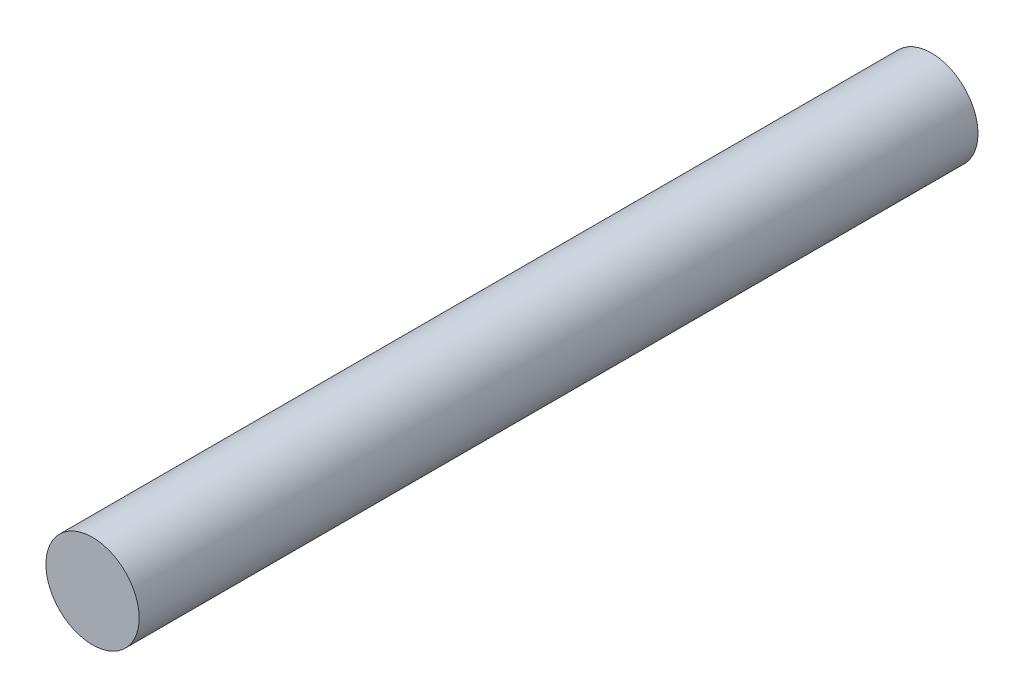
ISO-10303-21;
HEADER;
FILE_DESCRIPTION(('STEP AP214'),'2;1');
FILE_NAME('part.step','',(''),(''),'','','');
FILE_SCHEMA(('AUTOMOTIVE_DESIGN { 1 0 10303 214 1 1 1 1 }'));
ENDSEC;
DATA;
#1=APPLICATION_CONTEXT('core data for automotive mechanical design processes');
#2=APPLICATION_PROTOCOL_DEFINITION('international standard','automotive_design',2000,#1);
#3=PRODUCT_CONTEXT('',#1,'mechanical');
#4=PRODUCT('Part','Part','',(#3));
#5=PRODUCT_RELATED_PRODUCT_CATEGORY('part','',(#4));
#6=PRODUCT_DEFINITION_FORMATION('','',#4);
#7=PRODUCT_DEFINITION_CONTEXT('part definition',#1,'design');
#8=PRODUCT_DEFINITION('design','',#6,#7);
#9=PRODUCT_DEFINITION_SHAPE('','',#8);
#10=(LENGTH_UNIT() NAMED_UNIT(*) SI_UNIT(.MILLI.,.METRE.));
#11=(NAMED_UNIT(*) PLANE_ANGLE_UNIT() SI_UNIT($,.RADIAN.));
#12=(NAMED_UNIT(*) SI_UNIT($,.STERADIAN.) SOLID_ANGLE_UNIT());
#13=UNCERTAINTY_MEASURE_WITH_UNIT(LENGTH_MEASURE(1.E-05),#10,'distance_accuracy_value','');
#14=(GEOMETRIC_REPRESENTATION_CONTEXT(3) GLOBAL_UNCERTAINTY_ASSIGNED_CONTEXT((#13)) GLOBAL_UNIT_ASSIGNED_CONTEXT((#10,
#11,#12)) REPRESENTATION_CONTEXT('',''));
#15=CARTESIAN_POINT('',(0.,0.,0.));
#16=DIRECTION('',(0.,0.,1.));
#17=DIRECTION('',(1.,0.,0.));
#18=AXIS2_PLACEMENT_3D('',#15,#16,#17);
#19=CARTESIAN_POINT('',(-0.924,-4.501,-9.1));
#20=DIRECTION('',(0.,0.,-1.));
#21=DIRECTION('',(-1.,0.,0.));
#22=AXIS2_PLACEMENT_3D('',#19,#20,#21);
#23=PLANE('',#22);
#24=CARTESIAN_POINT('',(-1.225,-4.2,-9.1));
#25=DIRECTION('',(0.,0.,1.));
#26=DIRECTION('',(1.,0.,0.));
#27=AXIS2_PLACEMENT_3D('',#24,#25,#26);
#28=CIRCLE('',#27,0.3);
#29=CARTESIAN_POINT('',(-0.925,-4.2,-9.1));
#30=VERTEX_POINT('',#29);
#31=EDGE_CURVE('E19',#30,#30,#28,.T.);
#32=ORIENTED_EDGE('',*,*,#31,.F.);
#33=EDGE_LOOP('',(#32));
#34=FACE_BOUND('',#33,.T.);
#35=ADVANCED_FACE('F15',(#34),#23,.T.);
#36=CARTESIAN_POINT('',(-1.225,-4.2,-9.1));
#37=DIRECTION('',(0.,0.,1.));
#38=DIRECTION('',(1.,0.,0.));
#39=AXIS2_PLACEMENT_3D('',#36,#37,#38);
#40=CYLINDRICAL_SURFACE('',#39,0.3);
#41=CARTESIAN_POINT('',(-1.225,-4.2,-3.7));
#42=DIRECTION('',(0.,0.,1.));
#43=DIRECTION('',(1.,0.,0.));
#44=AXIS2_PLACEMENT_3D('',#41,#42,#43);
#45=CIRCLE('',#44,0.3);
#46=CARTESIAN_POINT('',(-0.925,-4.2,-3.7));
#47=VERTEX_POINT('',#46);
#48=EDGE_CURVE('E10',#47,#47,#45,.T.);
#49=ORIENTED_EDGE('',*,*,#48,.F.);
#50=EDGE_LOOP('',(#49));
#51=FACE_BOUND('',#50,.T.);
#52=ORIENTED_EDGE('',*,*,#31,.T.);
#53=EDGE_LOOP('',(#52));
#54=FACE_BOUND('',#53,.T.);
#55=ADVANCED_FACE('F28',(#51,#54),#40,.T.);
#56=CARTESIAN_POINT('',(-0.924,-3.899,-3.7));
#57=DIRECTION('',(0.,0.,1.));
#58=DIRECTION('',(-1.,0.,0.));
#59=AXIS2_PLACEMENT_3D('',#56,#57,#58);
#60=PLANE('',#59);
#61=ORIENTED_EDGE('',*,*,#48,.T.);
#62=EDGE_LOOP('',(#61));
#63=FACE_BOUND('',#62,.T.);
#64=ADVANCED_FACE('F17',(#63),#60,.T.);
#65=CLOSED_SHELL('',(#35,#55,#64));
#66=MANIFOLD_SOLID_BREP('B1',#65);
#67=ADVANCED_BREP_SHAPE_REPRESENTATION('',(#18,#66),#14);
#68=SHAPE_DEFINITION_REPRESENTATION(#9,#67);
ENDSEC;
END-ISO-10303-21;
